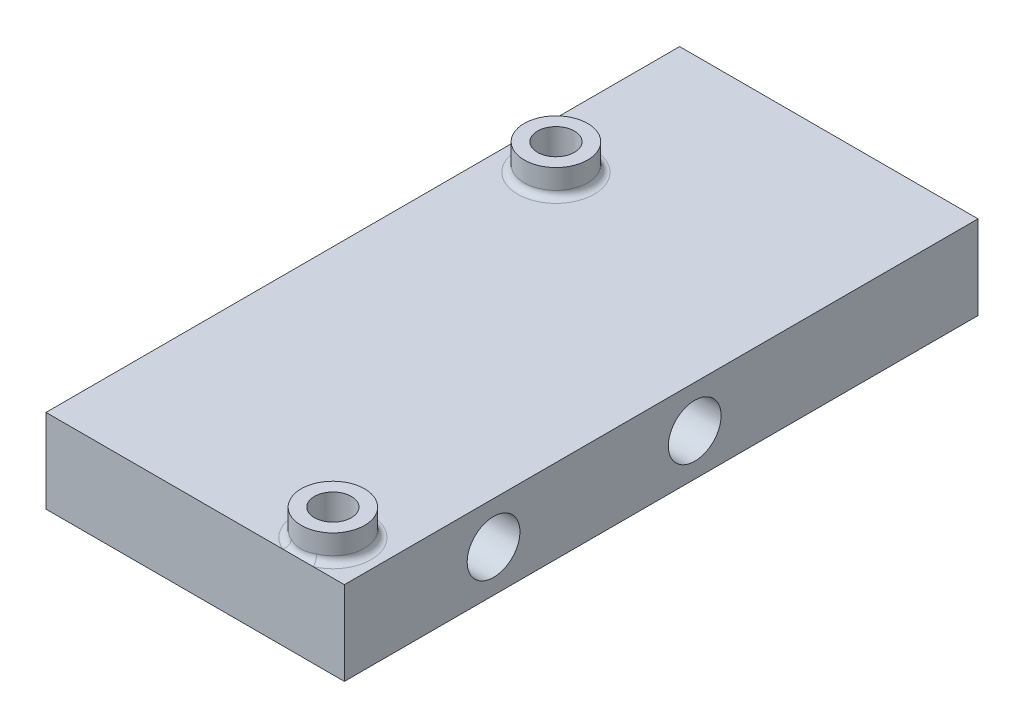
ISO-10303-21;
HEADER;
FILE_DESCRIPTION(('STEP AP214'),'2;1');
FILE_NAME('part.step','',(''),(''),'','','');
FILE_SCHEMA(('AUTOMOTIVE_DESIGN { 1 0 10303 214 1 1 1 1 }'));
ENDSEC;
DATA;
#1=APPLICATION_CONTEXT('core data for automotive mechanical design processes');
#2=APPLICATION_PROTOCOL_DEFINITION('international standard','automotive_design',2000,#1);
#3=PRODUCT_CONTEXT('',#1,'mechanical');
#4=PRODUCT('Part','Part','',(#3));
#5=PRODUCT_RELATED_PRODUCT_CATEGORY('part','',(#4));
#6=PRODUCT_DEFINITION_FORMATION('','',#4);
#7=PRODUCT_DEFINITION_CONTEXT('part definition',#1,'design');
#8=PRODUCT_DEFINITION('design','',#6,#7);
#9=PRODUCT_DEFINITION_SHAPE('','',#8);
#10=(LENGTH_UNIT() NAMED_UNIT(*) SI_UNIT(.MILLI.,.METRE.));
#11=(NAMED_UNIT(*) PLANE_ANGLE_UNIT() SI_UNIT($,.RADIAN.));
#12=(NAMED_UNIT(*) SI_UNIT($,.STERADIAN.) SOLID_ANGLE_UNIT());
#13=UNCERTAINTY_MEASURE_WITH_UNIT(LENGTH_MEASURE(1.E-05),#10,'distance_accuracy_value','');
#14=(GEOMETRIC_REPRESENTATION_CONTEXT(3) GLOBAL_UNCERTAINTY_ASSIGNED_CONTEXT((#13)) GLOBAL_UNIT_ASSIGNED_CONTEXT((#10,
#11,#12)) REPRESENTATION_CONTEXT('',''));
#15=CARTESIAN_POINT('',(0.,0.,0.));
#16=DIRECTION('',(0.,0.,1.));
#17=DIRECTION('',(1.,0.,0.));
#18=AXIS2_PLACEMENT_3D('',#15,#16,#17);
#19=CARTESIAN_POINT('',(0.,6.35,0.));
#20=DIRECTION('',(0.,1.,0.));
#21=DIRECTION('',(0.,0.,1.));
#22=AXIS2_PLACEMENT_3D('',#19,#20,#21);
#23=PLANE('',#22);
#24=CARTESIAN_POINT('',(3.6835,6.35,-35.20575));
#25=DIRECTION('',(0.,1.,0.));
#26=DIRECTION('',(0.,0.,1.));
#27=AXIS2_PLACEMENT_3D('',#24,#25,#26);
#28=CIRCLE('',#27,2.9);
#29=CARTESIAN_POINT('',(3.6835,6.35,-32.30575));
#30=VERTEX_POINT('',#29);
#31=EDGE_CURVE('E168',#30,#30,#28,.F.);
#32=ORIENTED_EDGE('',*,*,#31,.T.);
#33=EDGE_LOOP('',(#32));
#34=FACE_BOUND('',#33,.T.);
#35=DIRECTION('',(1.,0.,0.));
#36=VECTOR('',#35,1.);
#37=CARTESIAN_POINT('',(0.,6.35,-0.127));
#38=LINE('',#37,#36);
#39=CARTESIAN_POINT('',(0.127,6.35,-0.127));
#40=VERTEX_POINT('',#39);
#41=CARTESIAN_POINT('',(18.0424000311186,6.35,-0.127));
#42=VERTEX_POINT('',#41);
#43=EDGE_CURVE('E121',#40,#42,#38,.T.);
#44=ORIENTED_EDGE('',*,*,#43,.T.);
#45=CARTESIAN_POINT('',(19.2073,6.35,-2.78275));
#46=DIRECTION('',(0.,1.,0.));
#47=DIRECTION('',(0.,0.,1.));
#48=AXIS2_PLACEMENT_3D('',#45,#46,#47);
#49=CIRCLE('',#48,2.9);
#50=CARTESIAN_POINT('',(20.3721999688814,6.35,-0.127));
#51=VERTEX_POINT('',#50);
#52=EDGE_CURVE('E60',#42,#51,#49,.F.);
#53=ORIENTED_EDGE('',*,*,#52,.T.);
#54=CARTESIAN_POINT('',(22.733,6.35,-0.127));
#55=VERTEX_POINT('',#54);
#56=EDGE_CURVE('E126',#51,#55,#38,.T.);
#57=ORIENTED_EDGE('',*,*,#56,.T.);
#58=DIRECTION('',(0.,0.,-1.));
#59=VECTOR('',#58,1.);
#60=CARTESIAN_POINT('',(22.733,6.35,0.));
#61=LINE('',#60,#59);
#62=CARTESIAN_POINT('',(22.733,6.35,-48.133));
#63=VERTEX_POINT('',#62);
#64=EDGE_CURVE('E124',#55,#63,#61,.T.);
#65=ORIENTED_EDGE('',*,*,#64,.T.);
#66=DIRECTION('',(1.,0.,0.));
#67=VECTOR('',#66,1.);
#68=CARTESIAN_POINT('',(0.,6.35,-48.133));
#69=LINE('',#68,#67);
#70=CARTESIAN_POINT('',(0.126999999999991,6.35,-48.133));
#71=VERTEX_POINT('',#70);
#72=EDGE_CURVE('E128',#71,#63,#69,.T.);
#73=ORIENTED_EDGE('',*,*,#72,.F.);
#74=DIRECTION('',(0.,0.,-1.));
#75=VECTOR('',#74,1.);
#76=CARTESIAN_POINT('',(0.127,6.35,0.));
#77=LINE('',#76,#75);
#78=EDGE_CURVE('E111',#40,#71,#77,.T.);
#79=ORIENTED_EDGE('',*,*,#78,.F.);
#80=EDGE_LOOP('',(#44,#53,#57,#65,#73,#79));
#81=FACE_BOUND('',#80,.T.);
#82=ADVANCED_FACE('F45',(#34,#81),#23,.T.);
#83=CARTESIAN_POINT('',(0.127,6.35,0.));
#84=DIRECTION('',(-1.,0.,0.));
#85=DIRECTION('',(0.,0.,1.));
#86=AXIS2_PLACEMENT_3D('',#83,#84,#85);
#87=PLANE('',#86);
#88=CARTESIAN_POINT('',(0.126999999999995,3.175,-26.67));
#89=DIRECTION('',(-1.,0.,0.));
#90=DIRECTION('',(0.,0.,1.));
#91=AXIS2_PLACEMENT_3D('',#88,#89,#90);
#92=CIRCLE('',#91,2.);
#93=CARTESIAN_POINT('',(0.126999999999996,3.175,-24.67));
#94=VERTEX_POINT('',#93);
#95=EDGE_CURVE('E224',#94,#94,#92,.T.);
#96=ORIENTED_EDGE('',*,*,#95,.F.);
#97=EDGE_LOOP('',(#96));
#98=FACE_BOUND('',#97,.T.);
#99=CARTESIAN_POINT('',(0.126999999999998,3.175,-11.43));
#100=DIRECTION('',(-1.,0.,0.));
#101=DIRECTION('',(0.,0.,1.));
#102=AXIS2_PLACEMENT_3D('',#99,#100,#101);
#103=CIRCLE('',#102,2.);
#104=CARTESIAN_POINT('',(0.126999999999998,3.175,-9.43));
#105=VERTEX_POINT('',#104);
#106=EDGE_CURVE('E216',#105,#105,#103,.T.);
#107=ORIENTED_EDGE('',*,*,#106,.F.);
#108=EDGE_LOOP('',(#107));
#109=FACE_BOUND('',#108,.T.);
#110=DIRECTION('',(0.,0.,-1.));
#111=VECTOR('',#110,1.);
#112=CARTESIAN_POINT('',(0.127,0.,0.));
#113=LINE('',#112,#111);
#114=CARTESIAN_POINT('',(0.127,0.,-0.127));
#115=VERTEX_POINT('',#114);
#116=CARTESIAN_POINT('',(0.126999999999991,0.,-48.133));
#117=VERTEX_POINT('',#116);
#118=EDGE_CURVE('E114',#115,#117,#113,.T.);
#119=ORIENTED_EDGE('',*,*,#118,.F.);
#120=DIRECTION('',(0.,-1.,0.));
#121=VECTOR('',#120,1.);
#122=CARTESIAN_POINT('',(0.127,6.35,-0.127));
#123=LINE('',#122,#121);
#124=EDGE_CURVE('E107',#40,#115,#123,.T.);
#125=ORIENTED_EDGE('',*,*,#124,.F.);
#126=ORIENTED_EDGE('',*,*,#78,.T.);
#127=DIRECTION('',(0.,-1.,0.));
#128=VECTOR('',#127,1.);
#129=CARTESIAN_POINT('',(0.126999999999991,6.35,-48.133));
#130=LINE('',#129,#128);
#131=EDGE_CURVE('E140',#71,#117,#130,.T.);
#132=ORIENTED_EDGE('',*,*,#131,.T.);
#133=EDGE_LOOP('',(#119,#125,#126,#132));
#134=FACE_BOUND('',#133,.T.);
#135=ADVANCED_FACE('F109',(#98,#109,#134),#87,.T.);
#136=CARTESIAN_POINT('',(0.,6.35,-0.127));
#137=DIRECTION('',(0.,0.,-1.));
#138=DIRECTION('',(-1.,0.,0.));
#139=AXIS2_PLACEMENT_3D('',#136,#137,#138);
#140=PLANE('',#139);
#141=DIRECTION('',(1.,0.,0.));
#142=VECTOR('',#141,1.);
#143=CARTESIAN_POINT('',(0.,0.,-0.127));
#144=LINE('',#143,#142);
#145=CARTESIAN_POINT('',(22.733,0.,-0.127));
#146=VERTEX_POINT('',#145);
#147=EDGE_CURVE('E142',#115,#146,#144,.T.);
#148=ORIENTED_EDGE('',*,*,#147,.T.);
#149=DIRECTION('',(0.,-1.,0.));
#150=VECTOR('',#149,1.);
#151=CARTESIAN_POINT('',(22.733,6.35,-0.127));
#152=LINE('',#151,#150);
#153=EDGE_CURVE('E118',#55,#146,#152,.T.);
#154=ORIENTED_EDGE('',*,*,#153,.F.);
#155=ORIENTED_EDGE('',*,*,#56,.F.);
#156=EDGE_CURVE('E123',#42,#51,#38,.T.);
#157=ORIENTED_EDGE('',*,*,#156,.F.);
#158=ORIENTED_EDGE('',*,*,#43,.F.);
#159=ORIENTED_EDGE('',*,*,#124,.T.);
#160=EDGE_LOOP('',(#148,#154,#155,#157,#158,#159));
#161=FACE_BOUND('',#160,.T.);
#162=ADVANCED_FACE('F122',(#161),#140,.F.);
#163=CARTESIAN_POINT('',(22.733,6.35,0.));
#164=DIRECTION('',(-1.,0.,0.));
#165=DIRECTION('',(0.,0.,1.));
#166=AXIS2_PLACEMENT_3D('',#163,#164,#165);
#167=PLANE('',#166);
#168=CARTESIAN_POINT('',(22.733,3.175,-26.67));
#169=DIRECTION('',(-1.,0.,0.));
#170=DIRECTION('',(0.,0.,1.));
#171=AXIS2_PLACEMENT_3D('',#168,#169,#170);
#172=CIRCLE('',#171,2.);
#173=CARTESIAN_POINT('',(22.733,3.175,-24.67));
#174=VERTEX_POINT('',#173);
#175=EDGE_CURVE('E143',#174,#174,#172,.T.);
#176=ORIENTED_EDGE('',*,*,#175,.T.);
#177=EDGE_LOOP('',(#176));
#178=FACE_BOUND('',#177,.T.);
#179=CARTESIAN_POINT('',(22.733,3.175,-11.43));
#180=DIRECTION('',(-1.,0.,0.));
#181=DIRECTION('',(0.,0.,1.));
#182=AXIS2_PLACEMENT_3D('',#179,#180,#181);
#183=CIRCLE('',#182,2.);
#184=CARTESIAN_POINT('',(22.733,3.175,-9.43000000000001));
#185=VERTEX_POINT('',#184);
#186=EDGE_CURVE('E135',#185,#185,#183,.T.);
#187=ORIENTED_EDGE('',*,*,#186,.T.);
#188=EDGE_LOOP('',(#187));
#189=FACE_BOUND('',#188,.T.);
#190=DIRECTION('',(0.,0.,-1.));
#191=VECTOR('',#190,1.);
#192=CARTESIAN_POINT('',(22.733,0.,0.));
#193=LINE('',#192,#191);
#194=CARTESIAN_POINT('',(22.733,0.,-48.133));
#195=VERTEX_POINT('',#194);
#196=EDGE_CURVE('E145',#146,#195,#193,.T.);
#197=ORIENTED_EDGE('',*,*,#196,.T.);
#198=DIRECTION('',(0.,-1.,0.));
#199=VECTOR('',#198,1.);
#200=CARTESIAN_POINT('',(22.733,6.35,-48.133));
#201=LINE('',#200,#199);
#202=EDGE_CURVE('E154',#63,#195,#201,.T.);
#203=ORIENTED_EDGE('',*,*,#202,.F.);
#204=ORIENTED_EDGE('',*,*,#64,.F.);
#205=ORIENTED_EDGE('',*,*,#153,.T.);
#206=EDGE_LOOP('',(#197,#203,#204,#205));
#207=FACE_BOUND('',#206,.T.);
#208=ADVANCED_FACE('F238',(#178,#189,#207),#167,.F.);
#209=CARTESIAN_POINT('',(19.2073,6.35,-2.78275));
#210=DIRECTION('',(0.,-1.,0.));
#211=DIRECTION('',(0.,0.,-1.));
#212=AXIS2_PLACEMENT_3D('',#209,#210,#211);
#213=CYLINDRICAL_SURFACE('',#212,1.4);
#214=CARTESIAN_POINT('',(19.2073,0.,-2.78275));
#215=DIRECTION('',(0.,1.,0.));
#216=DIRECTION('',(0.,0.,1.));
#217=AXIS2_PLACEMENT_3D('',#214,#215,#216);
#218=CIRCLE('',#217,1.4);
#219=CARTESIAN_POINT('',(19.2073,0.,-1.38275));
#220=VERTEX_POINT('',#219);
#221=EDGE_CURVE('E132',#220,#220,#218,.T.);
#222=ORIENTED_EDGE('',*,*,#221,.F.);
#223=EDGE_LOOP('',(#222));
#224=FACE_BOUND('',#223,.T.);
#225=CARTESIAN_POINT('',(19.2073,8.35,-2.78275));
#226=DIRECTION('',(0.,1.,0.));
#227=DIRECTION('',(0.,0.,1.));
#228=AXIS2_PLACEMENT_3D('',#225,#226,#227);
#229=CIRCLE('',#228,1.4);
#230=CARTESIAN_POINT('',(19.2073,8.35,-1.38275));
#231=VERTEX_POINT('',#230);
#232=EDGE_CURVE('E218',#231,#231,#229,.T.);
#233=ORIENTED_EDGE('',*,*,#232,.T.);
#234=EDGE_LOOP('',(#233));
#235=FACE_BOUND('',#234,.T.);
#236=ADVANCED_FACE('F268',(#224,#235),#213,.F.);
#237=CARTESIAN_POINT('',(0.,6.35,-48.133));
#238=DIRECTION('',(0.,0.,-1.));
#239=DIRECTION('',(-1.,0.,0.));
#240=AXIS2_PLACEMENT_3D('',#237,#238,#239);
#241=PLANE('',#240);
#242=DIRECTION('',(1.,0.,0.));
#243=VECTOR('',#242,1.);
#244=CARTESIAN_POINT('',(0.,0.,-48.133));
#245=LINE('',#244,#243);
#246=EDGE_CURVE('E148',#117,#195,#245,.T.);
#247=ORIENTED_EDGE('',*,*,#246,.F.);
#248=ORIENTED_EDGE('',*,*,#131,.F.);
#249=ORIENTED_EDGE('',*,*,#72,.T.);
#250=ORIENTED_EDGE('',*,*,#202,.T.);
#251=EDGE_LOOP('',(#247,#248,#249,#250));
#252=FACE_BOUND('',#251,.T.);
#253=ADVANCED_FACE('F269',(#252),#241,.T.);
#254=CARTESIAN_POINT('',(3.6835,6.35,-35.20575));
#255=DIRECTION('',(0.,-1.,0.));
#256=DIRECTION('',(0.,0.,-1.));
#257=AXIS2_PLACEMENT_3D('',#254,#255,#256);
#258=CYLINDRICAL_SURFACE('',#257,1.4);
#259=CARTESIAN_POINT('',(3.6835,0.,-35.20575));
#260=DIRECTION('',(0.,1.,0.));
#261=DIRECTION('',(0.,0.,1.));
#262=AXIS2_PLACEMENT_3D('',#259,#260,#261);
#263=CIRCLE('',#262,1.4);
#264=CARTESIAN_POINT('',(3.6835,0.,-33.80575));
#265=VERTEX_POINT('',#264);
#266=EDGE_CURVE('E129',#265,#265,#263,.T.);
#267=ORIENTED_EDGE('',*,*,#266,.F.);
#268=EDGE_LOOP('',(#267));
#269=FACE_BOUND('',#268,.T.);
#270=CARTESIAN_POINT('',(3.6835,8.35,-35.20575));
#271=DIRECTION('',(0.,1.,0.));
#272=DIRECTION('',(0.,0.,1.));
#273=AXIS2_PLACEMENT_3D('',#270,#271,#272);
#274=CIRCLE('',#273,1.4);
#275=CARTESIAN_POINT('',(3.6835,8.35,-33.80575));
#276=VERTEX_POINT('',#275);
#277=EDGE_CURVE('E213',#276,#276,#274,.T.);
#278=ORIENTED_EDGE('',*,*,#277,.T.);
#279=EDGE_LOOP('',(#278));
#280=FACE_BOUND('',#279,.T.);
#281=ADVANCED_FACE('F276',(#269,#280),#258,.F.);
#282=CARTESIAN_POINT('',(0.,0.,0.));
#283=DIRECTION('',(0.,1.,0.));
#284=DIRECTION('',(0.,0.,1.));
#285=AXIS2_PLACEMENT_3D('',#282,#283,#284);
#286=PLANE('',#285);
#287=ORIENTED_EDGE('',*,*,#118,.T.);
#288=ORIENTED_EDGE('',*,*,#246,.T.);
#289=ORIENTED_EDGE('',*,*,#196,.F.);
#290=ORIENTED_EDGE('',*,*,#147,.F.);
#291=EDGE_LOOP('',(#287,#288,#289,#290));
#292=FACE_BOUND('',#291,.T.);
#293=ORIENTED_EDGE('',*,*,#221,.T.);
#294=EDGE_LOOP('',(#293));
#295=FACE_BOUND('',#294,.T.);
#296=ORIENTED_EDGE('',*,*,#266,.T.);
#297=EDGE_LOOP('',(#296));
#298=FACE_BOUND('',#297,.T.);
#299=ADVANCED_FACE('F252',(#292,#295,#298),#286,.F.);
#300=CARTESIAN_POINT('',(22.733,3.175,-11.43));
#301=DIRECTION('',(-1.,0.,0.));
#302=DIRECTION('',(0.,0.,1.));
#303=AXIS2_PLACEMENT_3D('',#300,#301,#302);
#304=CYLINDRICAL_SURFACE('',#303,2.);
#305=ORIENTED_EDGE('',*,*,#186,.F.);
#306=EDGE_LOOP('',(#305));
#307=FACE_BOUND('',#306,.T.);
#308=ORIENTED_EDGE('',*,*,#106,.T.);
#309=EDGE_LOOP('',(#308));
#310=FACE_BOUND('',#309,.T.);
#311=ADVANCED_FACE('F229',(#307,#310),#304,.F.);
#312=CARTESIAN_POINT('',(22.733,3.175,-26.67));
#313=DIRECTION('',(-1.,0.,0.));
#314=DIRECTION('',(0.,0.,1.));
#315=AXIS2_PLACEMENT_3D('',#312,#313,#314);
#316=CYLINDRICAL_SURFACE('',#315,2.);
#317=ORIENTED_EDGE('',*,*,#175,.F.);
#318=EDGE_LOOP('',(#317));
#319=FACE_BOUND('',#318,.T.);
#320=ORIENTED_EDGE('',*,*,#95,.T.);
#321=EDGE_LOOP('',(#320));
#322=FACE_BOUND('',#321,.T.);
#323=ADVANCED_FACE('F242',(#319,#322),#316,.F.);
#324=CARTESIAN_POINT('',(3.6835,8.35,-35.20575));
#325=DIRECTION('',(0.,1.,0.));
#326=DIRECTION('',(0.,0.,1.));
#327=AXIS2_PLACEMENT_3D('',#324,#325,#326);
#328=PLANE('',#327);
#329=CARTESIAN_POINT('',(3.6835,8.35,-35.20575));
#330=DIRECTION('',(0.,1.,0.));
#331=DIRECTION('',(0.,0.,1.));
#332=AXIS2_PLACEMENT_3D('',#329,#330,#331);
#333=CIRCLE('',#332,2.4);
#334=CARTESIAN_POINT('',(3.6835,8.35,-32.80575));
#335=VERTEX_POINT('',#334);
#336=EDGE_CURVE('E211',#335,#335,#333,.T.);
#337=ORIENTED_EDGE('',*,*,#336,.T.);
#338=EDGE_LOOP('',(#337));
#339=FACE_BOUND('',#338,.T.);
#340=ORIENTED_EDGE('',*,*,#277,.F.);
#341=EDGE_LOOP('',(#340));
#342=FACE_BOUND('',#341,.T.);
#343=ADVANCED_FACE('F207',(#339,#342),#328,.T.);
#344=CARTESIAN_POINT('',(3.6835,8.35,-35.20575));
#345=DIRECTION('',(0.,-1.,0.));
#346=DIRECTION('',(0.,0.,-1.));
#347=AXIS2_PLACEMENT_3D('',#344,#345,#346);
#348=CYLINDRICAL_SURFACE('',#347,2.4);
#349=CARTESIAN_POINT('',(3.6835,6.85,-35.20575));
#350=DIRECTION('',(0.,1.,0.));
#351=DIRECTION('',(0.,0.,1.));
#352=AXIS2_PLACEMENT_3D('',#349,#350,#351);
#353=CIRCLE('',#352,2.4);
#354=CARTESIAN_POINT('',(3.6835,6.85,-32.80575));
#355=VERTEX_POINT('',#354);
#356=EDGE_CURVE('E11',#355,#355,#353,.T.);
#357=ORIENTED_EDGE('',*,*,#356,.T.);
#358=EDGE_LOOP('',(#357));
#359=FACE_BOUND('',#358,.T.);
#360=ORIENTED_EDGE('',*,*,#336,.F.);
#361=EDGE_LOOP('',(#360));
#362=FACE_BOUND('',#361,.T.);
#363=ADVANCED_FACE('F203',(#359,#362),#348,.T.);
#364=CARTESIAN_POINT('',(19.2073,8.35,-2.78275));
#365=DIRECTION('',(0.,1.,0.));
#366=DIRECTION('',(0.,0.,1.));
#367=AXIS2_PLACEMENT_3D('',#364,#365,#366);
#368=PLANE('',#367);
#369=CARTESIAN_POINT('',(19.2073,8.35,-2.78275));
#370=DIRECTION('',(0.,1.,0.));
#371=DIRECTION('',(0.,0.,1.));
#372=AXIS2_PLACEMENT_3D('',#369,#370,#371);
#373=CIRCLE('',#372,2.4);
#374=CARTESIAN_POINT('',(19.2073,8.35,-0.382749999999999));
#375=VERTEX_POINT('',#374);
#376=EDGE_CURVE('E193',#375,#375,#373,.T.);
#377=ORIENTED_EDGE('',*,*,#376,.T.);
#378=EDGE_LOOP('',(#377));
#379=FACE_BOUND('',#378,.T.);
#380=ORIENTED_EDGE('',*,*,#232,.F.);
#381=EDGE_LOOP('',(#380));
#382=FACE_BOUND('',#381,.T.);
#383=ADVANCED_FACE('F206',(#379,#382),#368,.T.);
#384=CARTESIAN_POINT('',(19.2073,8.35,-2.78275));
#385=DIRECTION('',(0.,-1.,0.));
#386=DIRECTION('',(0.,0.,-1.));
#387=AXIS2_PLACEMENT_3D('',#384,#385,#386);
#388=CYLINDRICAL_SURFACE('',#387,2.4);
#389=CARTESIAN_POINT('',(19.2073,6.85,-2.78275));
#390=DIRECTION('',(0.,1.,0.));
#391=DIRECTION('',(0.,0.,1.));
#392=AXIS2_PLACEMENT_3D('',#389,#390,#391);
#393=CIRCLE('',#392,2.4);
#394=CARTESIAN_POINT('',(20.1713551466605,6.85,-0.584887931034483));
#395=VERTEX_POINT('',#394);
#396=CARTESIAN_POINT('',(18.2432448533395,6.85,-0.584887931034483));
#397=VERTEX_POINT('',#396);
#398=EDGE_CURVE('E117',#395,#397,#393,.T.);
#399=ORIENTED_EDGE('',*,*,#398,.T.);
#400=CARTESIAN_POINT('',(17.9015966638145,6.7977733189655,-0.769012480392724));
#401=CARTESIAN_POINT('',(18.0636659176995,6.08321858696752,-0.663927103857674));
#402=CARTESIAN_POINT('',(17.6295751354425,6.35,-0.127));
#403=CARTESIAN_POINT('',(17.9270181169827,6.80764399861361,-0.752521978513563));
#404=CARTESIAN_POINT('',(18.0648589496174,6.11140469747592,-0.66596282892295));
#405=CARTESIAN_POINT('',(17.6602927246416,6.35,-0.127));
#406=CARTESIAN_POINT('',(17.9530442420014,6.8157386085815,-0.736338017220193));
#407=CARTESIAN_POINT('',(18.0705065880584,6.13877283338844,-0.664617525295859));
#408=CARTESIAN_POINT('',(17.6917409590331,6.35,-0.127));
#409=CARTESIAN_POINT('',(18.0060156858876,6.82897325501405,-0.704804700123466));
#410=CARTESIAN_POINT('',(18.088835034199,6.18956719082137,-0.657207851036493));
#411=CARTESIAN_POINT('',(17.7557481204125,6.35,-0.127));
#412=CARTESIAN_POINT('',(18.0329585778727,6.83412053346705,-0.689453383244626));
#413=CARTESIAN_POINT('',(18.1012349072567,6.21322569959805,-0.651337969917937));
#414=CARTESIAN_POINT('',(17.7883041149173,6.35,-0.127));
#415=CARTESIAN_POINT('',(18.1144236455082,6.84601800029349,-0.645130186548763));
#416=CARTESIAN_POINT('',(18.1450840702512,6.27639610824977,-0.630262261782591));
#417=CARTESIAN_POINT('',(17.88674107168,6.35,-0.127));
#418=CARTESIAN_POINT('',(18.1700534220207,6.84938075828693,-0.617582367618574));
#419=CARTESIAN_POINT('',(18.1840778141088,6.31213293302549,-0.61120281010143));
#420=CARTESIAN_POINT('',(17.9539603849482,6.35,-0.127));
#421=CARTESIAN_POINT('',(18.2811068752478,6.85044087695223,-0.567859529699544));
#422=CARTESIAN_POINT('',(18.2718320099394,6.36871987406319,-0.572103893033086));
#423=CARTESIAN_POINT('',(18.0881499742515,6.35,-0.127));
#424=CARTESIAN_POINT('',(18.3364602277256,6.84834572023621,-0.545521917045972));
#425=CARTESIAN_POINT('',(18.3199403220127,6.39096638034963,-0.552065825965578));
#426=CARTESIAN_POINT('',(18.1550352751663,6.35,-0.127));
#427=CARTESIAN_POINT('',(18.4485814969373,6.84122711894476,-0.505053961003699));
#428=CARTESIAN_POINT('',(18.422463923301,6.42636802934612,-0.513922759916089));
#429=CARTESIAN_POINT('',(18.2905151421337,6.35,-0.127));
#430=CARTESIAN_POINT('',(18.5053502417225,6.83620191980012,-0.486926147631369));
#431=CARTESIAN_POINT('',(18.4770807979691,6.44003735431473,-0.495573933379244));
#432=CARTESIAN_POINT('',(18.3591107087485,6.35,-0.127));
#433=CARTESIAN_POINT('',(18.62024285386,6.82511277055642,-0.454889036943664));
#434=CARTESIAN_POINT('',(18.5904472947603,6.46121817946244,-0.462452265235377));
#435=CARTESIAN_POINT('',(18.497939281747,6.35,-0.127));
#436=CARTESIAN_POINT('',(18.6783713534609,6.81904461175035,-0.440997490490062));
#437=CARTESIAN_POINT('',(18.6495726170394,6.46898112154932,-0.447444550488382));
#438=CARTESIAN_POINT('',(18.5681778854311,6.35,-0.127));
#439=CARTESIAN_POINT('',(18.7955451877507,6.80756257874993,-0.41758051839537));
#440=CARTESIAN_POINT('',(18.7702439879334,6.48052263781625,-0.421960172657613));
#441=CARTESIAN_POINT('',(18.7097629351981,6.35,-0.127));
#442=CARTESIAN_POINT('',(18.8545904737289,6.8021486699273,-0.40805486160089));
#443=CARTESIAN_POINT('',(18.832220632692,6.48443197467418,-0.411285435188853));
#444=CARTESIAN_POINT('',(18.7811093224222,6.35,-0.127));
#445=CARTESIAN_POINT('',(18.9779465170455,6.79303377593089,-0.392865004198704));
#446=CARTESIAN_POINT('',(18.9622366446269,6.49009738996274,-0.394293806524068));
#447=CARTESIAN_POINT('',(18.9301645414301,6.35,-0.127));
#448=CARTESIAN_POINT('',(19.0423107397827,6.78949803853789,-0.387557235805698));
#449=CARTESIAN_POINT('',(19.0310194594593,6.49172858903665,-0.388214817548787));
#450=CARTESIAN_POINT('',(19.0079379772374,6.35,-0.127));
#451=CARTESIAN_POINT('',(19.1713201268826,6.78589374355325,-0.382151754582388));
#452=CARTESIAN_POINT('',(19.1686472961698,6.49337098308842,-0.382080218820011));
#453=CARTESIAN_POINT('',(19.163824319983,6.35,-0.127));
#454=CARTESIAN_POINT('',(19.2359652447939,6.78582463299334,-0.382053210818598));
#455=CARTESIAN_POINT('',(19.2381225374191,6.49339766342999,-0.38196690438938));
#456=CARTESIAN_POINT('',(19.2419371707926,6.35,-0.127));
#457=CARTESIAN_POINT('',(19.3650481736468,6.78917452375301,-0.38706794223099));
#458=CARTESIAN_POINT('',(19.375857371256,6.49188037988117,-0.387658946351585));
#459=CARTESIAN_POINT('',(19.3979123764899,6.35,-0.127));
#460=CARTESIAN_POINT('',(19.4294857156619,6.79259698184453,-0.392186382394401));
#461=CARTESIAN_POINT('',(19.4447478333292,6.49032082672647,-0.39352292963558));
#462=CARTESIAN_POINT('',(19.4757744064248,6.35,-0.127));
#463=CARTESIAN_POINT('',(19.5576215404229,6.8018884284398,-0.40757805602721));
#464=CARTESIAN_POINT('',(19.5799594921415,6.4846351623253,-0.41076528733184));
#465=CARTESIAN_POINT('',(19.6306051946776,6.35,-0.127));
#466=CARTESIAN_POINT('',(19.6213196510168,6.80775797537399,-0.41785246620807));
#467=CARTESIAN_POINT('',(19.6468802340121,6.48044574807355,-0.422303319663678));
#468=CARTESIAN_POINT('',(19.7075737449784,6.35,-0.127));
#469=CARTESIAN_POINT('',(19.7449584467593,6.81992868774011,-0.4429354045412));
#470=CARTESIAN_POINT('',(19.7739889013913,6.46794439040584,-0.44954502466165));
#471=CARTESIAN_POINT('',(19.8569706231677,6.35,-0.127));
#472=CARTESIAN_POINT('',(19.8049440314418,6.82620105635857,-0.457533540078549));
#473=CARTESIAN_POINT('',(19.8348854187786,6.45965717075943,-0.46528988891095));
#474=CARTESIAN_POINT('',(19.9294532046596,6.35,-0.127));
#475=CARTESIAN_POINT('',(19.9236248198614,6.83750770866016,-0.491313358300514));
#476=CARTESIAN_POINT('',(19.9515187275369,6.43685770348088,-0.500043298062179));
#477=CARTESIAN_POINT('',(20.0728591573317,6.35,-0.127));
#478=CARTESIAN_POINT('',(19.982321384859,6.84254336190027,-0.51048992390801));
#479=CARTESIAN_POINT('',(20.0076424705742,6.42203305878721,-0.519324283554944));
#480=CARTESIAN_POINT('',(20.1437841733685,6.35,-0.127));
#481=CARTESIAN_POINT('',(20.0981854189811,6.84923331204557,-0.55337098248355));
#482=CARTESIAN_POINT('',(20.1123823593325,6.38339090725072,-0.559185357473758));
#483=CARTESIAN_POINT('',(20.2837865479383,6.35,-0.127));
#484=CARTESIAN_POINT('',(20.1553537519878,6.85088956094028,-0.577072852916803));
#485=CARTESIAN_POINT('',(20.1611976400455,6.35895935920079,-0.580032240167027));
#486=CARTESIAN_POINT('',(20.3528649503292,6.35,-0.127));
#487=CARTESIAN_POINT('',(20.2396536081741,6.84883941126707,-0.615906959849136));
#488=CARTESIAN_POINT('',(20.224698777439,6.31390593784279,-0.60887754305466));
#489=CARTESIAN_POINT('',(20.4547272765514,6.35,-0.127));
#490=CARTESIAN_POINT('',(20.2675655904255,6.84739284056377,-0.62942877296543));
#491=CARTESIAN_POINT('',(20.244696346156,6.29691874248225,-0.618325592026996));
#492=CARTESIAN_POINT('',(20.4884542551018,6.35,-0.127));
#493=CARTESIAN_POINT('',(20.3227819932988,6.84253587180543,-0.657505759557935));
#494=CARTESIAN_POINT('',(20.2808001810138,6.25949484932578,-0.635612651248372));
#495=CARTESIAN_POINT('',(20.5551740752352,6.35,-0.127));
#496=CARTESIAN_POINT('',(20.3500856845496,6.83912323547589,-0.672062094203439));
#497=CARTESIAN_POINT('',(20.2968166449128,6.23888124000881,-0.643417833742417));
#498=CARTESIAN_POINT('',(20.5881660354949,6.35,-0.127));
#499=CARTESIAN_POINT('',(20.3770123623455,6.83450791533849,-0.687094257904928));
#500=CARTESIAN_POINT('',(20.31000138395,6.21676786331121,-0.649691373324398));
#501=CARTESIAN_POINT('',(20.6207024378342,6.35,-0.127));
#502=(BOUNDED_SURFACE() B_SPLINE_SURFACE(3,2,((#400,#401,#402),(#403,#404,#405),(#406,#407,
#408),(#409,#410,#411),(#412,#413,#414),(#415,#416,#417),(#418,#419,#420),(#421,#422,#423),
(#424,#425,#426),(#427,#428,#429),(#430,#431,#432),(#433,#434,#435),(#436,#437,#438),(#439,#440,
#441),(#442,#443,#444),(#445,#446,#447),(#448,#449,#450),(#451,#452,#453),(#454,#455,#456),
(#457,#458,#459),(#460,#461,#462),(#463,#464,#465),(#466,#467,#468),(#469,#470,#471),(#472,#473,
#474),(#475,#476,#477),(#478,#479,#480),(#481,#482,#483),(#484,#485,#486),(#487,#488,#489),
(#490,#491,#492),(#493,#494,#495),(#496,#497,#498),(#499,#500,#501)),.UNSPECIFIED.,.F.,.F.,
.F.) B_SPLINE_SURFACE_WITH_KNOTS((4,2,2,2,2,2,2,2,2,2,2,2,2,2,2,2,4),(3,3),(0.,
0.113617349955816,0.226954315470747,0.451559447570381,0.667751882782304,0.884073911588363,
1.10129030048189,1.31849518745705,1.55253165803421,1.78653079688904,2.02076182789745,
2.25504634016588,2.47941127325539,2.7035266094245,2.9275124568645,3.03995421014397,
3.15252422681546),(0.,1.),
.UNSPECIFIED.) GEOMETRIC_REPRESENTATION_ITEM() RATIONAL_B_SPLINE_SURFACE(((1.,0.559752907937761,
1.),(1.,0.573319818783315,1.),(1.,0.586512185049889,1.),(1.,0.612031475500325,1.),(1.,
0.624360455076955,1.),(1.,0.659759683034488,1.),(1.,0.681492141366901,1.),(1.,0.720453946684556,
1.),(1.,0.737821471168214,1.),(1.,0.769148375253003,1.),(1.,0.783105705647799,1.),(1.,
0.807701933994561,1.),(1.,0.818326873670231,1.),(1.,0.836205708096781,1.),(1.,0.843459781319518,
1.),(1.,0.855017253842755,1.),(1.,0.8590484398157,1.),(1.,0.863153780491954,1.),(1.,
0.863228566288301,1.),(1.,0.859420099709399,1.),(1.,0.855532924861673,1.),(1.,0.843823169480579,
1.),(1.,0.835999690590631,1.),(1.,0.816845541125548,1.),(1.,0.805677389524289,1.),(1.,
0.77973034786962,1.),(1.,0.764955488438139,1.),(1.,0.731724496024175,1.),(1.,0.713270494929819,
1.),(1.,0.682772868138393,1.),(1.,0.672113495736843,1.),(1.,0.649863793703292,1.),(1.,
0.638272415989576,1.),(1.,0.626228112866719,1.))) REPRESENTATION_ITEM('') SURFACE());
#503=CARTESIAN_POINT('',(17.9015966638145,6.7977733189655,-0.769012480392724));
#504=CARTESIAN_POINT('',(17.9270181169827,6.80764399861361,-0.752521978513563));
#505=CARTESIAN_POINT('',(17.9530442420014,6.8157386085815,-0.736338017220193));
#506=CARTESIAN_POINT('',(18.0060156858876,6.82897325501405,-0.704804700123466));
#507=CARTESIAN_POINT('',(18.0329585778727,6.83412053346705,-0.689453383244626));
#508=CARTESIAN_POINT('',(18.1144236455082,6.84601800029349,-0.645130186548763));
#509=CARTESIAN_POINT('',(18.1700534220207,6.84938075828693,-0.617582367618574));
#510=CARTESIAN_POINT('',(18.2811068752478,6.85044087695223,-0.567859529699544));
#511=CARTESIAN_POINT('',(18.3364602277256,6.84834572023621,-0.545521917045972));
#512=CARTESIAN_POINT('',(18.4485814969373,6.84122711894476,-0.505053961003699));
#513=CARTESIAN_POINT('',(18.5053502417225,6.83620191980012,-0.486926147631369));
#514=CARTESIAN_POINT('',(18.62024285386,6.82511277055642,-0.454889036943664));
#515=CARTESIAN_POINT('',(18.6783713534609,6.81904461175035,-0.440997490490062));
#516=CARTESIAN_POINT('',(18.7955451877507,6.80756257874993,-0.41758051839537));
#517=CARTESIAN_POINT('',(18.8545904737289,6.8021486699273,-0.40805486160089));
#518=CARTESIAN_POINT('',(18.9779465170455,6.79303377593089,-0.392865004198703));
#519=CARTESIAN_POINT('',(19.0423107397827,6.78949803853789,-0.387557235805698));
#520=CARTESIAN_POINT('',(19.1713201268826,6.78589374355324,-0.382151754582388));
#521=CARTESIAN_POINT('',(19.2359652447939,6.78582463299334,-0.382053210818598));
#522=CARTESIAN_POINT('',(19.3650481736468,6.78917452375301,-0.38706794223099));
#523=CARTESIAN_POINT('',(19.4294857156619,6.79259698184453,-0.392186382394401));
#524=CARTESIAN_POINT('',(19.5576215404229,6.8018884284398,-0.40757805602721));
#525=CARTESIAN_POINT('',(19.6213196510168,6.80775797537399,-0.41785246620807));
#526=CARTESIAN_POINT('',(19.7449584467593,6.81992868774011,-0.4429354045412));
#527=CARTESIAN_POINT('',(19.8049440314418,6.82620105635857,-0.457533540078549));
#528=CARTESIAN_POINT('',(19.9236248198614,6.83750770866016,-0.491313358300514));
#529=CARTESIAN_POINT('',(19.982321384859,6.84254336190028,-0.51048992390801));
#530=CARTESIAN_POINT('',(20.0981854189811,6.84923331204557,-0.55337098248355));
#531=CARTESIAN_POINT('',(20.1553537519878,6.85088956094028,-0.577072852916803));
#532=CARTESIAN_POINT('',(20.2396536081741,6.84883941126707,-0.615906959849136));
#533=CARTESIAN_POINT('',(20.2675655904255,6.84739284056377,-0.62942877296543));
#534=CARTESIAN_POINT('',(20.3227819932988,6.84253587180543,-0.657505759557935));
#535=CARTESIAN_POINT('',(20.3500856845496,6.83912323547589,-0.672062094203439));
#536=CARTESIAN_POINT('',(20.3770123623455,6.83450791533849,-0.687094257904928));
#537=B_SPLINE_CURVE_WITH_KNOTS('',3,(#503,#504,#505,#506,#507,#508,#509,#510,#511,#512,#513,
#514,#515,#516,#517,#518,#519,#520,#521,#522,#523,#524,#525,#526,#527,#528,#529,#530,#531,#532,
#533,#534,#535,#536),.UNSPECIFIED.,.F.,.F.,(4,2,2,2,2,2,2,2,2,2,2,2,2,2,2,2,4),(0.,
0.113617349955816,0.226954315470747,0.451559447570381,0.667751882782304,0.884073911588363,
1.10129030048189,1.31849518745705,1.55253165803421,1.78653079688904,2.02076182789745,
2.25504634016588,2.47941127325539,2.7035266094245,2.9275124568645,3.03995421014397,
3.15252422681546),.UNSPECIFIED.);
#538=EDGE_CURVE('E159',#397,#395,#537,.T.);
#539=ORIENTED_EDGE('',*,*,#538,.T.);
#540=EDGE_LOOP('',(#399,#539));
#541=FACE_BOUND('',#540,.T.);
#542=ORIENTED_EDGE('',*,*,#376,.F.);
#543=EDGE_LOOP('',(#542));
#544=FACE_BOUND('',#543,.T.);
#545=ADVANCED_FACE('F170',(#541,#544),#388,.T.);
#546=CARTESIAN_POINT('',(19.2073,6.85,-2.78275));
#547=DIRECTION('',(0.,1.,0.));
#548=DIRECTION('',(0.,0.,1.));
#549=AXIS2_PLACEMENT_3D('',#546,#547,#548);
#550=TOROIDAL_SURFACE('',#549,2.9,0.5);
#551=CARTESIAN_POINT('',(20.3721999688814,6.85,-0.127));
#552=DIRECTION('',(0.915775862068966,0.,-0.401689644441879));
#553=DIRECTION('',(-0.401689644441879,0.,-0.915775862068966));
#554=AXIS2_PLACEMENT_3D('',#551,#552,#553);
#555=CIRCLE('',#554,0.5);
#556=EDGE_CURVE('E194',#51,#395,#555,.T.);
#557=ORIENTED_EDGE('',*,*,#556,.F.);
#558=ORIENTED_EDGE('',*,*,#52,.F.);
#559=CARTESIAN_POINT('',(18.0424000311186,6.85,-0.127));
#560=DIRECTION('',(-0.915775862068966,0.,-0.401689644441879));
#561=DIRECTION('',(-0.401689644441879,0.,0.915775862068966));
#562=AXIS2_PLACEMENT_3D('',#559,#560,#561);
#563=CIRCLE('',#562,0.5);
#564=EDGE_CURVE('E75',#397,#42,#563,.T.);
#565=ORIENTED_EDGE('',*,*,#564,.F.);
#566=ORIENTED_EDGE('',*,*,#398,.F.);
#567=EDGE_LOOP('',(#557,#558,#565,#566));
#568=FACE_BOUND('',#567,.T.);
#569=ADVANCED_FACE('F181',(#568),#550,.F.);
#570=ORIENTED_EDGE('',*,*,#564,.T.);
#571=ORIENTED_EDGE('',*,*,#156,.T.);
#572=ORIENTED_EDGE('',*,*,#556,.T.);
#573=ORIENTED_EDGE('',*,*,#538,.F.);
#574=EDGE_LOOP('',(#570,#571,#572,#573));
#575=FACE_BOUND('',#574,.T.);
#576=ADVANCED_FACE('F177',(#575),#502,.F.);
#577=CARTESIAN_POINT('',(3.6835,6.85,-35.20575));
#578=DIRECTION('',(0.,1.,0.));
#579=DIRECTION('',(0.,0.,1.));
#580=AXIS2_PLACEMENT_3D('',#577,#578,#579);
#581=TOROIDAL_SURFACE('',#580,2.9,0.5);
#582=ORIENTED_EDGE('',*,*,#31,.F.);
#583=EDGE_LOOP('',(#582));
#584=FACE_BOUND('',#583,.T.);
#585=ORIENTED_EDGE('',*,*,#356,.F.);
#586=EDGE_LOOP('',(#585));
#587=FACE_BOUND('',#586,.T.);
#588=ADVANCED_FACE('F47',(#584,#587),#581,.F.);
#589=CLOSED_SHELL('',(#82,#135,#162,#208,#236,#253,#281,#299,#311,#323,#343,#363,#383,#545,#569,
#576,#588));
#590=MANIFOLD_SOLID_BREP('B2',#589);
#591=ADVANCED_BREP_SHAPE_REPRESENTATION('',(#18,#590),#14);
#592=SHAPE_DEFINITION_REPRESENTATION(#9,#591);
ENDSEC;
END-ISO-10303-21;
